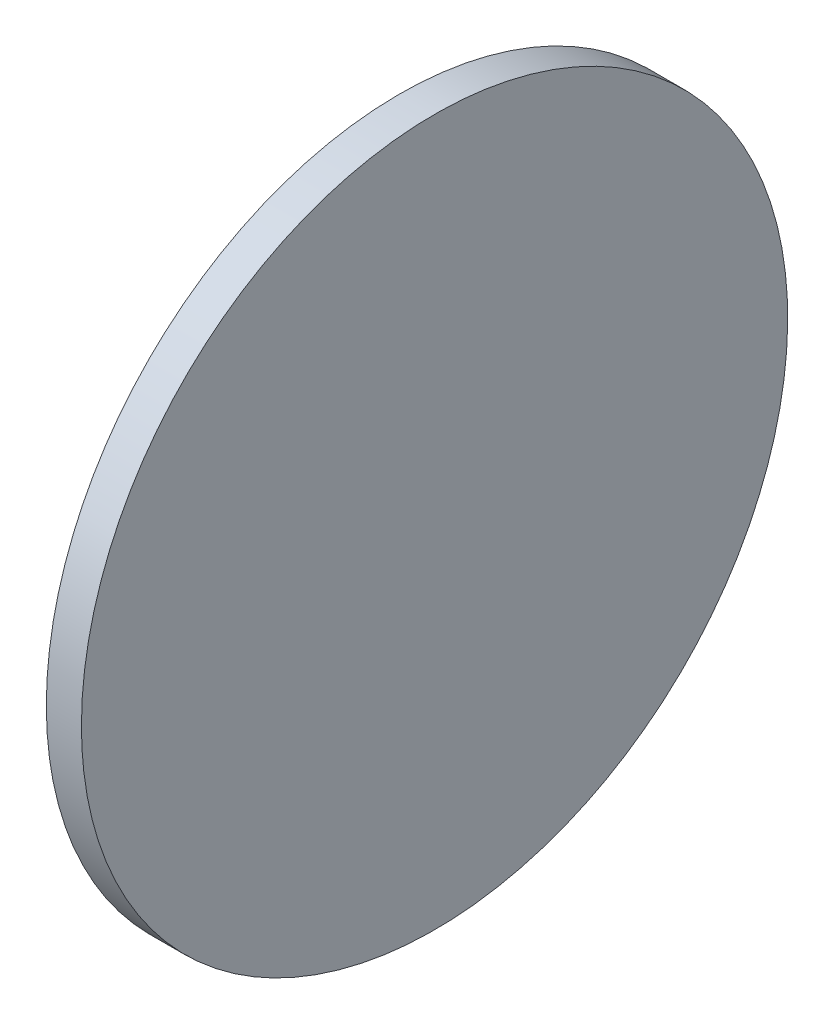
ISO-10303-21;
HEADER;
FILE_DESCRIPTION(('STEP AP214'),'2;1');
FILE_NAME('part.step','',(''),(''),'','','');
FILE_SCHEMA(('AUTOMOTIVE_DESIGN { 1 0 10303 214 1 1 1 1 }'));
ENDSEC;
DATA;
#1=APPLICATION_CONTEXT('core data for automotive mechanical design processes');
#2=APPLICATION_PROTOCOL_DEFINITION('international standard','automotive_design',2000,#1);
#3=PRODUCT_CONTEXT('',#1,'mechanical');
#4=PRODUCT('Part','Part','',(#3));
#5=PRODUCT_RELATED_PRODUCT_CATEGORY('part','',(#4));
#6=PRODUCT_DEFINITION_FORMATION('','',#4);
#7=PRODUCT_DEFINITION_CONTEXT('part definition',#1,'design');
#8=PRODUCT_DEFINITION('design','',#6,#7);
#9=PRODUCT_DEFINITION_SHAPE('','',#8);
#10=(LENGTH_UNIT() NAMED_UNIT(*) SI_UNIT(.MILLI.,.METRE.));
#11=(NAMED_UNIT(*) PLANE_ANGLE_UNIT() SI_UNIT($,.RADIAN.));
#12=(NAMED_UNIT(*) SI_UNIT($,.STERADIAN.) SOLID_ANGLE_UNIT());
#13=UNCERTAINTY_MEASURE_WITH_UNIT(LENGTH_MEASURE(1.E-05),#10,'distance_accuracy_value','');
#14=(GEOMETRIC_REPRESENTATION_CONTEXT(3) GLOBAL_UNCERTAINTY_ASSIGNED_CONTEXT((#13)) GLOBAL_UNIT_ASSIGNED_CONTEXT((#10,
#11,#12)) REPRESENTATION_CONTEXT('',''));
#15=CARTESIAN_POINT('',(0.,0.,0.));
#16=DIRECTION('',(0.,0.,1.));
#17=DIRECTION('',(1.,0.,0.));
#18=AXIS2_PLACEMENT_3D('',#15,#16,#17);
#19=CARTESIAN_POINT('',(-57.6828547032886,-10.1015554934087,30.2828427124814));
#20=CARTESIAN_POINT('',(-57.6828547032886,-9.42855059459681,30.2828427124814));
#21=CARTESIAN_POINT('',(-57.6828547032885,-8.08254079697294,30.150272318581));
#22=CARTESIAN_POINT('',(-57.6828547032886,-6.14111570304469,29.5613474548658));
#23=CARTESIAN_POINT('',(-57.6828547032886,-4.3518880892199,28.6049853705257));
#24=CARTESIAN_POINT('',(-57.6828547032886,-2.78361696928747,27.3179385241281));
#25=CARTESIAN_POINT('',(-57.6828547032886,-1.49657012288981,25.7496674041957));
#26=CARTESIAN_POINT('',(-57.6828547032886,-0.540208038549796,23.9604397903709));
#27=CARTESIAN_POINT('',(-57.6828547032886,0.0487168251654114,22.0190146964426));
#28=CARTESIAN_POINT('',(-57.6828547032886,0.247572416016112,20.0000000000068));
#29=CARTESIAN_POINT('',(-57.6828547032886,0.0487168251654121,17.980985303571));
#30=CARTESIAN_POINT('',(-57.6828547032886,-0.540208038549797,16.0395602096428));
#31=CARTESIAN_POINT('',(-57.6828547032886,-1.49657012288981,14.250332595818));
#32=CARTESIAN_POINT('',(-57.6828547032886,-2.78361696928747,12.6820614758856));
#33=CARTESIAN_POINT('',(-57.6828547032886,-4.3518880892199,11.3950146294879));
#34=CARTESIAN_POINT('',(-57.6828547032886,-6.14111570304469,10.4386525451479));
#35=CARTESIAN_POINT('',(-57.6828547032886,-8.08254079697294,9.84972768143268));
#36=CARTESIAN_POINT('',(-57.6828547032886,-10.1015554934087,9.65087209058198));
#37=CARTESIAN_POINT('',(-57.6828547032886,-12.1205701898445,9.84972768143268));
#38=CARTESIAN_POINT('',(-57.6828547032886,-14.0619952837728,10.4386525451479));
#39=CARTESIAN_POINT('',(-57.6828547032886,-15.8512228975976,11.3950146294879));
#40=CARTESIAN_POINT('',(-57.6828547032886,-17.41949401753,12.6820614758856));
#41=CARTESIAN_POINT('',(-57.6828547032886,-18.7065408639277,14.250332595818));
#42=CARTESIAN_POINT('',(-57.6828547032886,-19.6629029482677,16.0395602096428));
#43=CARTESIAN_POINT('',(-57.6828547032886,-20.2518278119829,17.980985303571));
#44=CARTESIAN_POINT('',(-57.6828547032886,-20.4506834028336,20.0000000000068));
#45=CARTESIAN_POINT('',(-57.6828547032886,-20.2518278119829,22.0190146964426));
#46=CARTESIAN_POINT('',(-57.6828547032886,-19.6629029482677,23.9604397903709));
#47=CARTESIAN_POINT('',(-57.6828547032886,-18.7065408639277,25.7496674041956));
#48=CARTESIAN_POINT('',(-57.6828547032886,-17.41949401753,27.3179385241281));
#49=CARTESIAN_POINT('',(-57.6828547032886,-15.8512228975976,28.6049853705257));
#50=CARTESIAN_POINT('',(-57.6828547032886,-14.0619952837728,29.5613474548658));
#51=CARTESIAN_POINT('',(-57.6828547032886,-12.1205701898445,30.150272318581));
#52=CARTESIAN_POINT('',(-57.6828547032886,-10.7745603922207,30.2828427124814));
#53=CARTESIAN_POINT('',(-57.6828547032886,-10.1015554934087,30.2828427124814));
#54=B_SPLINE_CURVE_WITH_KNOTS('',3,(#19,#20,#21,#22,#23,#24,#25,#26,#27,#28,#29,#30,#31,#32,#33,
#34,#35,#36,#37,#38,#39,#40,#41,#42,#43,#44,#45,#46,#47,#48,#49,#50,#51,#52,#53),.UNSPECIFIED.,
.T.,.F.,(4,1,1,1,1,1,1,1,1,1,1,1,1,1,1,1,1,1,1,1,1,1,1,1,1,1,1,1,1,1,1,1,4),(0.,0.03125,0.0625,
0.09375,0.125,0.15625,0.1875,0.21875,0.25,0.28125,0.3125,0.34375,0.375,0.40625,0.4375,0.46875,
0.5,0.53125,0.5625,0.59375,0.625,0.65625,0.6875,0.71875,0.75,0.78125,0.8125,0.84375,0.875,
0.90625,0.9375,0.96875,1.),.UNSPECIFIED.);
#55=DIRECTION('',(-1.,0.,0.));
#56=VECTOR('',#55,1.);
#57=SURFACE_OF_LINEAR_EXTRUSION('',#54,#56);
#58=CARTESIAN_POINT('',(-57.6828547032886,-10.1015554934087,30.2828427124814));
#59=CARTESIAN_POINT('',(-57.6828547032886,-9.42855059459681,30.2828427124814));
#60=CARTESIAN_POINT('',(-57.6828547032885,-8.08254079697294,30.150272318581));
#61=CARTESIAN_POINT('',(-57.6828547032886,-6.14111570304469,29.5613474548658));
#62=CARTESIAN_POINT('',(-57.6828547032885,-4.3518880892199,28.6049853705257));
#63=CARTESIAN_POINT('',(-57.6828547032886,-2.78361696928747,27.3179385241281));
#64=CARTESIAN_POINT('',(-57.6828547032886,-1.49657012288981,25.7496674041957));
#65=CARTESIAN_POINT('',(-57.6828547032886,-0.540208038549796,23.9604397903709));
#66=CARTESIAN_POINT('',(-57.6828547032886,0.0487168251654114,22.0190146964426));
#67=CARTESIAN_POINT('',(-57.6828547032885,0.247572416016112,20.0000000000068));
#68=CARTESIAN_POINT('',(-57.6828547032886,0.0487168251654121,17.980985303571));
#69=CARTESIAN_POINT('',(-57.6828547032885,-0.540208038549797,16.0395602096428));
#70=CARTESIAN_POINT('',(-57.6828547032886,-1.49657012288981,14.250332595818));
#71=CARTESIAN_POINT('',(-57.6828547032886,-2.78361696928747,12.6820614758856));
#72=CARTESIAN_POINT('',(-57.6828547032886,-4.3518880892199,11.3950146294879));
#73=CARTESIAN_POINT('',(-57.6828547032885,-6.14111570304469,10.4386525451479));
#74=CARTESIAN_POINT('',(-57.6828547032886,-8.08254079697294,9.84972768143268));
#75=CARTESIAN_POINT('',(-57.6828547032886,-10.1015554934087,9.65087209058198));
#76=CARTESIAN_POINT('',(-57.6828547032886,-12.1205701898445,9.84972768143268));
#77=CARTESIAN_POINT('',(-57.6828547032886,-14.0619952837728,10.4386525451479));
#78=CARTESIAN_POINT('',(-57.6828547032886,-15.8512228975976,11.3950146294879));
#79=CARTESIAN_POINT('',(-57.6828547032886,-17.41949401753,12.6820614758856));
#80=CARTESIAN_POINT('',(-57.6828547032886,-18.7065408639277,14.250332595818));
#81=CARTESIAN_POINT('',(-57.6828547032885,-19.6629029482677,16.0395602096428));
#82=CARTESIAN_POINT('',(-57.6828547032886,-20.2518278119829,17.980985303571));
#83=CARTESIAN_POINT('',(-57.6828547032885,-20.4506834028336,20.0000000000068));
#84=CARTESIAN_POINT('',(-57.6828547032886,-20.2518278119829,22.0190146964426));
#85=CARTESIAN_POINT('',(-57.6828547032886,-19.6629029482677,23.9604397903709));
#86=CARTESIAN_POINT('',(-57.6828547032886,-18.7065408639277,25.7496674041956));
#87=CARTESIAN_POINT('',(-57.6828547032886,-17.41949401753,27.3179385241281));
#88=CARTESIAN_POINT('',(-57.6828547032886,-15.8512228975976,28.6049853705257));
#89=CARTESIAN_POINT('',(-57.6828547032886,-14.0619952837728,29.5613474548658));
#90=CARTESIAN_POINT('',(-57.6828547032886,-12.1205701898445,30.150272318581));
#91=CARTESIAN_POINT('',(-57.6828547032886,-10.7745603922207,30.2828427124814));
#92=CARTESIAN_POINT('',(-57.6828547032886,-10.1015554934087,30.2828427124814));
#93=B_SPLINE_CURVE_WITH_KNOTS('',3,(#58,#59,#60,#61,#62,#63,#64,#65,#66,#67,#68,#69,#70,#71,#72,
#73,#74,#75,#76,#77,#78,#79,#80,#81,#82,#83,#84,#85,#86,#87,#88,#89,#90,#91,#92),.UNSPECIFIED.,
.T.,.F.,(4,1,1,1,1,1,1,1,1,1,1,1,1,1,1,1,1,1,1,1,1,1,1,1,1,1,1,1,1,1,1,1,4),(0.,0.03125,0.0625,
0.09375,0.125,0.15625,0.1875,0.21875,0.25,0.28125,0.3125,0.34375,0.375,0.40625,0.4375,0.46875,
0.5,0.53125,0.5625,0.59375,0.625,0.65625,0.6875,0.71875,0.75,0.78125,0.8125,0.84375,0.875,
0.90625,0.9375,0.96875,1.),.UNSPECIFIED.);
#94=CARTESIAN_POINT('',(-57.6828547032886,-10.1015554934087,30.2828427124814));
#95=VERTEX_POINT('',#94);
#96=EDGE_CURVE('E9',#95,#95,#93,.T.);
#97=ORIENTED_EDGE('',*,*,#96,.T.);
#98=EDGE_LOOP('',(#97));
#99=FACE_BOUND('',#98,.T.);
#100=CARTESIAN_POINT('',(-58.7052049368191,-10.1015554934087,30.2828427124814));
#101=CARTESIAN_POINT('',(-58.7052049368192,-10.2698077512351,30.2828426775823));
#102=CARTESIAN_POINT('',(-58.7052049368192,-10.438058784543,30.2786998381964));
#103=CARTESIAN_POINT('',(-58.7052049368191,-10.7741567433599,30.2621683753116));
#104=CARTESIAN_POINT('',(-58.7052049368191,-10.9420036657198,30.2497796877606));
#105=CARTESIAN_POINT('',(-58.7052049368191,-11.276889117429,30.2167963546452));
#106=CARTESIAN_POINT('',(-58.7052049368191,-11.4439276467783,30.1962017090808));
#107=CARTESIAN_POINT('',(-58.7052049368191,-11.7767930540147,30.1468460112992));
#108=CARTESIAN_POINT('',(-58.7052049368191,-11.9426199413037,30.1180850225185));
#109=CARTESIAN_POINT('',(-58.7052049368191,-12.2726572375495,30.0524365236886));
#110=CARTESIAN_POINT('',(-58.7052049368191,-12.4368676465063,30.0155490136396));
#111=CARTESIAN_POINT('',(-58.7052049368191,-12.7632828148587,29.9337656470033));
#112=CARTESIAN_POINT('',(-58.7052049368191,-12.9254875586649,29.8888697282104));
#113=CARTESIAN_POINT('',(-58.7052049368191,-13.247503453177,29.7911872746742));
#114=CARTESIAN_POINT('',(-58.7052049368191,-13.407314603883,29.7384007399309));
#115=CARTESIAN_POINT('',(-58.7052049368191,-13.7241553029591,29.6250545719401));
#116=CARTESIAN_POINT('',(-58.7052049368191,-13.8811848729266,29.5644949990759));
#117=CARTESIAN_POINT('',(-58.7052049368191,-14.1920732012511,29.4357208371141));
#118=CARTESIAN_POINT('',(-58.7052049368191,-14.3459319596082,29.3675062480165));
#119=CARTESIAN_POINT('',(-58.7052049368191,-14.6501200105826,29.2236138850579));
#120=CARTESIAN_POINT('',(-58.7052049368191,-14.8004492757742,29.1479360532279));
#121=CARTESIAN_POINT('',(-58.7052049368191,-15.0972208233463,28.9893083562185));
#122=CARTESIAN_POINT('',(-58.7052049368191,-15.2436631057269,28.9063584910392));
#123=CARTESIAN_POINT('',(-58.7052049368191,-15.5323030593363,28.733377683839));
#124=CARTESIAN_POINT('',(-58.7052049368191,-15.6745007635276,28.6433467968277));
#125=CARTESIAN_POINT('',(-58.7052049368191,-15.9542928670367,28.4563956902046));
#126=CARTESIAN_POINT('',(-58.7052049368191,-16.0918872663545,28.3594754705927));
#127=CARTESIAN_POINT('',(-58.7052049368191,-16.3621584218092,28.15900381422));
#128=CARTESIAN_POINT('',(-58.7052049368191,-16.4948351397382,28.0554523259545));
#129=CARTESIAN_POINT('',(-58.7052049368191,-16.7549575767466,27.841975358883));
#130=CARTESIAN_POINT('',(-58.7052049368191,-16.8824032958261,27.7320498800771));
#131=CARTESIAN_POINT('',(-58.7052049368191,-17.1317502322838,27.5060819890863));
#132=CARTESIAN_POINT('',(-58.7052049368191,-17.2536514927231,27.3900396244234));
#133=CARTESIAN_POINT('',(-58.7052049368191,-17.4915951178253,27.1520959993212));
#134=CARTESIAN_POINT('',(-58.7052049368191,-17.6076374824882,27.0301947388819));
#135=CARTESIAN_POINT('',(-58.7052049368191,-17.833605373479,26.7808478024241));
#136=CARTESIAN_POINT('',(-58.7052049368191,-17.9435308522849,26.6534020833447));
#137=CARTESIAN_POINT('',(-58.7052049368191,-18.1570078193564,26.3932796463363));
#138=CARTESIAN_POINT('',(-58.7052049368191,-18.2605593076219,26.2606029284073));
#139=CARTESIAN_POINT('',(-58.7052049368191,-18.4610309639946,25.9903317729525));
#140=CARTESIAN_POINT('',(-58.7052049368191,-18.5579511836065,25.8527373736347));
#141=CARTESIAN_POINT('',(-58.7052049368191,-18.7449022902296,25.5729452701258));
#142=CARTESIAN_POINT('',(-58.7052049368191,-18.8349331772409,25.4307475659347));
#143=CARTESIAN_POINT('',(-58.7052049368191,-19.0079139844411,25.1421076123246));
#144=CARTESIAN_POINT('',(-58.7052049368191,-19.0908638496205,24.9956653299431));
#145=CARTESIAN_POINT('',(-58.7052049368191,-19.2494915466297,24.6988937823736));
#146=CARTESIAN_POINT('',(-58.7052049368191,-19.3251693784596,24.5485645171857));
#147=CARTESIAN_POINT('',(-58.7052049368191,-19.4690617414186,24.2443764662012));
#148=CARTESIAN_POINT('',(-58.7052049368191,-19.5372763305169,24.0905177078304));
#149=CARTESIAN_POINT('',(-58.7052049368191,-19.6660504924769,23.7796293795435));
#150=CARTESIAN_POINT('',(-58.7052049368191,-19.7266100653386,23.6225998096273));
#151=CARTESIAN_POINT('',(-58.7052049368191,-19.8399562333363,23.305759110411));
#152=CARTESIAN_POINT('',(-58.7052049368191,-19.8927427680891,23.1459479595134));
#153=CARTESIAN_POINT('',(-58.7052049368191,-19.9904252215994,22.8239320655246));
#154=CARTESIAN_POINT('',(-58.7052049368191,-20.035321140357,22.6617273224333));
#155=CARTESIAN_POINT('',(-58.7052049368191,-20.1171045070897,22.3353121521278));
#156=CARTESIAN_POINT('',(-58.7052049368191,-20.1539920172704,22.1711017405033));
#157=CARTESIAN_POINT('',(-58.7052049368191,-20.2196405157405,21.8410644515461));
#158=CARTESIAN_POINT('',(-58.7052049368191,-20.2484015040298,21.6752375742135));
#159=CARTESIAN_POINT('',(-58.7052049368191,-20.2977572031541,21.3423721397755));
#160=CARTESIAN_POINT('',(-58.7052049368191,-20.3183518505527,21.1753335732679));
#161=CARTESIAN_POINT('',(-58.7052049368191,-20.3513351786568,20.8404482230771));
#162=CARTESIAN_POINT('',(-58.7052049368191,-20.3637238593622,20.6726014393939));
#163=CARTESIAN_POINT('',(-58.7052049368191,-20.3802553409496,20.3365031017066));
#164=CARTESIAN_POINT('',(-58.7052049368191,-20.3843982058833,20.1682515508567));
#165=CARTESIAN_POINT('',(-58.7052049368191,-20.3843982058833,19.8317484491569));
#166=CARTESIAN_POINT('',(-58.7052049368191,-20.3802553409496,19.6634968983071));
#167=CARTESIAN_POINT('',(-58.7052049368191,-20.3637238593622,19.3273985606197));
#168=CARTESIAN_POINT('',(-58.7052049368191,-20.3513351786568,19.1595517769366));
#169=CARTESIAN_POINT('',(-58.7052049368191,-20.3183518505527,18.8246664267458));
#170=CARTESIAN_POINT('',(-58.7052049368191,-20.2977572031541,18.6576278602381));
#171=CARTESIAN_POINT('',(-58.7052049368191,-20.2484015040298,18.3247624258001));
#172=CARTESIAN_POINT('',(-58.7052049368191,-20.2196405157405,18.1589355484675));
#173=CARTESIAN_POINT('',(-58.7052049368191,-20.1539920172704,17.8288982595104));
#174=CARTESIAN_POINT('',(-58.7052049368191,-20.1171045070897,17.6646878478858));
#175=CARTESIAN_POINT('',(-58.7052049368191,-20.035321140357,17.3382726775803));
#176=CARTESIAN_POINT('',(-58.7052049368191,-19.9904252215994,17.176067934489));
#177=CARTESIAN_POINT('',(-58.7052049368191,-19.8927427680891,16.8540520405002));
#178=CARTESIAN_POINT('',(-58.7052049368191,-19.8399562333363,16.6942408896027));
#179=CARTESIAN_POINT('',(-58.7052049368191,-19.7266100653386,16.3774001903863));
#180=CARTESIAN_POINT('',(-58.7052049368191,-19.6660504924769,16.2203706204702));
#181=CARTESIAN_POINT('',(-58.7052049368191,-19.5372763305169,15.9094822921832));
#182=CARTESIAN_POINT('',(-58.7052049368191,-19.4690617414186,15.7556235338124));
#183=CARTESIAN_POINT('',(-58.7052049368191,-19.3251693784596,15.4514354828279));
#184=CARTESIAN_POINT('',(-58.7052049368191,-19.2494915466297,15.30110621764));
#185=CARTESIAN_POINT('',(-58.7052049368191,-19.0908638496205,15.0043346700706));
#186=CARTESIAN_POINT('',(-58.7052049368191,-19.0079139844411,14.857892387689));
#187=CARTESIAN_POINT('',(-58.7052049368191,-18.8349331772409,14.5692524340789));
#188=CARTESIAN_POINT('',(-58.7052049368191,-18.7449022902296,14.4270547298878));
#189=CARTESIAN_POINT('',(-58.7052049368191,-18.5579511836065,14.1472626263789));
#190=CARTESIAN_POINT('',(-58.7052049368191,-18.4610309639946,14.0096682270611));
#191=CARTESIAN_POINT('',(-58.7052049368191,-18.2605593076219,13.7393970716063));
#192=CARTESIAN_POINT('',(-58.7052049368191,-18.1570078193564,13.6067203536774));
#193=CARTESIAN_POINT('',(-58.7052049368191,-17.9435308522849,13.346597916669));
#194=CARTESIAN_POINT('',(-58.7052049368191,-17.833605373479,13.2191521975895));
#195=CARTESIAN_POINT('',(-58.7052049368191,-17.6076374824882,12.9698052611318));
#196=CARTESIAN_POINT('',(-58.7052049368191,-17.4915951178253,12.8479040006925));
#197=CARTESIAN_POINT('',(-58.7052049368191,-17.2536514927231,12.6099603755902));
#198=CARTESIAN_POINT('',(-58.7052049368191,-17.1317502322838,12.4939180109274));
#199=CARTESIAN_POINT('',(-58.7052049368191,-16.882403295826,12.2679501199366));
#200=CARTESIAN_POINT('',(-58.7052049368191,-16.7549575767466,12.1580246411306));
#201=CARTESIAN_POINT('',(-58.7052049368191,-16.4948351397382,11.9445476740592));
#202=CARTESIAN_POINT('',(-58.7052049368191,-16.3621584218092,11.8409961857937));
#203=CARTESIAN_POINT('',(-58.7052049368191,-16.0918872663544,11.640524529421));
#204=CARTESIAN_POINT('',(-58.7052049368191,-15.9542928670366,11.5436043098091));
#205=CARTESIAN_POINT('',(-58.7052049368191,-15.6745007635277,11.3566532031859));
#206=CARTESIAN_POINT('',(-58.7052049368191,-15.5323030593366,11.2666223161747));
#207=CARTESIAN_POINT('',(-58.7052049368191,-15.2436631057266,11.0936415089744));
#208=CARTESIAN_POINT('',(-58.7052049368191,-15.097220823345,11.0106916437951));
#209=CARTESIAN_POINT('',(-58.7052049368191,-14.8004492757755,10.8520639467858));
#210=CARTESIAN_POINT('',(-58.7052049368191,-14.6501200105876,10.776386114956));
#211=CARTESIAN_POINT('',(-58.7052049368191,-14.3459319596032,10.6324937519969));
#212=CARTESIAN_POINT('',(-58.7052049368191,-14.1920732012324,10.5642791628987));
#213=CARTESIAN_POINT('',(-58.7052049368191,-13.8811848729454,10.4355050009387));
#214=CARTESIAN_POINT('',(-58.7052049368191,-13.7241553030292,10.374945428077));
#215=CARTESIAN_POINT('',(-58.7052049368191,-13.4073146038129,10.2615992600793));
#216=CARTESIAN_POINT('',(-58.7052049368191,-13.2475034529153,10.2088127253265));
#217=CARTESIAN_POINT('',(-58.7052049368191,-12.9254875589265,10.1111302718161));
#218=CARTESIAN_POINT('',(-58.7052049368191,-12.7632828158352,10.0662343530585));
#219=CARTESIAN_POINT('',(-58.7052049368191,-12.4368676455298,9.98445098632588));
#220=CARTESIAN_POINT('',(-58.7052049368191,-12.2726572339052,9.94756347614512));
#221=CARTESIAN_POINT('',(-58.7052049368191,-11.942619944948,9.88191497767508));
#222=CARTESIAN_POINT('',(-58.7052049368191,-11.7767930676154,9.85315398938581));
#223=CARTESIAN_POINT('',(-58.7052049368191,-11.4439276331774,9.80379829026144));
#224=CARTESIAN_POINT('',(-58.7052049368191,-11.2768890666698,9.78320364286281));
#225=CARTESIAN_POINT('',(-58.7052049368191,-10.942003716479,9.75022031475877));
#226=CARTESIAN_POINT('',(-58.7052049368191,-10.7741569327958,9.73783163405335));
#227=CARTESIAN_POINT('',(-58.7052049368191,-10.4380585951085,9.72130015246599));
#228=CARTESIAN_POINT('',(-58.7052049368191,-10.2698070442586,9.71715728753221));
#229=CARTESIAN_POINT('',(-58.7052049368191,-9.93330394255885,9.71715728753221));
#230=CARTESIAN_POINT('',(-58.7052049368191,-9.76505239170897,9.72130015246599));
#231=CARTESIAN_POINT('',(-58.7052049368191,-9.42895405402162,9.73783163405335));
#232=CARTESIAN_POINT('',(-58.7052049368191,-9.26110727033847,9.75022031475876));
#233=CARTESIAN_POINT('',(-58.7052049368191,-8.92622192014769,9.78320364286281));
#234=CARTESIAN_POINT('',(-58.7052049368191,-8.75918335364005,9.80379829026144));
#235=CARTESIAN_POINT('',(-58.7052049368191,-8.42631791920202,9.85315398938581));
#236=CARTESIAN_POINT('',(-58.7052049368191,-8.26049104186944,9.88191497767508));
#237=CARTESIAN_POINT('',(-58.7052049368191,-7.93045375291229,9.94756347614511));
#238=CARTESIAN_POINT('',(-58.7052049368191,-7.7662433412877,9.98445098632587));
#239=CARTESIAN_POINT('',(-58.7052049368191,-7.43982817098224,10.0662343530585));
#240=CARTESIAN_POINT('',(-58.7052049368191,-7.27762342789096,10.1111302718161));
#241=CARTESIAN_POINT('',(-58.7052049368191,-6.95560753390214,10.2088127253265));
#242=CARTESIAN_POINT('',(-58.7052049368191,-6.7957963830046,10.2615992600792));
#243=CARTESIAN_POINT('',(-58.7052049368191,-6.47895568378826,10.374945428077));
#244=CARTESIAN_POINT('',(-58.7052049368191,-6.32192611387209,10.4355050009387));
#245=CARTESIAN_POINT('',(-58.7052049368191,-6.01103778558511,10.5642791628987));
#246=CARTESIAN_POINT('',(-58.7052049368191,-5.85717902721431,10.6324937519969));
#247=CARTESIAN_POINT('',(-58.7052049368191,-5.55299097622983,10.776386114956));
#248=CARTESIAN_POINT('',(-58.7052049368191,-5.40266171104194,10.8520639467858));
#249=CARTESIAN_POINT('',(-58.7052049368191,-5.10589016347248,11.0106916437951));
#250=CARTESIAN_POINT('',(-58.7052049368191,-4.95944788109091,11.0936415089744));
#251=CARTESIAN_POINT('',(-58.7052049368191,-4.67080792748083,11.2666223161747));
#252=CARTESIAN_POINT('',(-58.7052049368191,-4.52861022328975,11.3566532031859));
#253=CARTESIAN_POINT('',(-58.7052049368191,-4.24881811978084,11.5436043098091));
#254=CARTESIAN_POINT('',(-58.7052049368192,-4.11122372046302,11.640524529421));
#255=CARTESIAN_POINT('',(-58.7052049368191,-3.84095256500824,11.8409961857937));
#256=CARTESIAN_POINT('',(-58.7052049368191,-3.70827584707929,11.9445476740592));
#257=CARTESIAN_POINT('',(-58.7052049368191,-3.44815341007088,12.1580246411306));
#258=CARTESIAN_POINT('',(-58.7052049368191,-3.32070769099142,12.2679501199366));
#259=CARTESIAN_POINT('',(-58.7052049368191,-3.07136075453369,12.4939180109274));
#260=CARTESIAN_POINT('',(-58.7052049368191,-2.94945949409437,12.6099603755902));
#261=CARTESIAN_POINT('',(-58.7052049368191,-2.71151586899216,12.8479040006925));
#262=CARTESIAN_POINT('',(-58.7052049368191,-2.59547350432927,12.9698052611318));
#263=CARTESIAN_POINT('',(-58.7052049368191,-2.3695056133385,13.2191521975895));
#264=CARTESIAN_POINT('',(-58.7052049368191,-2.25958013453255,13.346597916669));
#265=CARTESIAN_POINT('',(-58.7052049368191,-2.04610316746108,13.6067203536774));
#266=CARTESIAN_POINT('',(-58.7052049368191,-1.94255167919557,13.7393970716063));
#267=CARTESIAN_POINT('',(-58.7052049368191,-1.74208002282288,14.0096682270611));
#268=CARTESIAN_POINT('',(-58.7052049368191,-1.64515980321099,14.1472626263789));
#269=CARTESIAN_POINT('',(-58.7052049368191,-1.45820869658784,14.4270547298878));
#270=CARTESIAN_POINT('',(-58.7052049368191,-1.36817780957657,14.5692524340789));
#271=CARTESIAN_POINT('',(-58.7052049368191,-1.19519700237634,14.857892387689));
#272=CARTESIAN_POINT('',(-58.7052049368191,-1.11224713719697,15.0043346700706));
#273=CARTESIAN_POINT('',(-58.7052049368191,-0.95361944018774,15.30110621764));
#274=CARTESIAN_POINT('',(-58.7052049368191,-0.877941608357881,15.4514354828279));
#275=CARTESIAN_POINT('',(-58.7052049368191,-0.734049245398835,15.7556235338124));
#276=CARTESIAN_POINT('',(-58.7052049368191,-0.66583465630058,15.9094822921832));
#277=CARTESIAN_POINT('',(-58.7052049368191,-0.537060494340616,16.2203706204702));
#278=CARTESIAN_POINT('',(-58.7052049368191,-0.476500921478905,16.3774001903863));
#279=CARTESIAN_POINT('',(-58.7052049368191,-0.363154753481161,16.6942408896027));
#280=CARTESIAN_POINT('',(-58.7052049368191,-0.310368218728401,16.8540520405002));
#281=CARTESIAN_POINT('',(-58.7052049368191,-0.212685765218039,17.176067934489));
#282=CARTESIAN_POINT('',(-58.7052049368191,-0.167789846460436,17.3382726775803));
#283=CARTESIAN_POINT('',(-58.7052049368191,-0.0860064797277837,17.6646878478858));
#284=CARTESIAN_POINT('',(-58.7052049368191,-0.0491189695470225,17.8288982595104));
#285=CARTESIAN_POINT('',(-58.7052049368191,0.0165295289230105,18.1589355484675));
#286=CARTESIAN_POINT('',(-58.7052049368191,0.0452905172122823,18.3247624258001));
#287=CARTESIAN_POINT('',(-58.7052049368191,0.09464621633665,18.6576278602381));
#288=CARTESIAN_POINT('',(-58.7052049368191,0.115240863735283,18.8246664267458));
#289=CARTESIAN_POINT('',(-58.7052049368191,0.148224191839329,19.1595517769366));
#290=CARTESIAN_POINT('',(-58.7052049368191,0.160612872544742,19.3273985606197));
#291=CARTESIAN_POINT('',(-58.7052049368191,0.177144354132105,19.6634968983071));
#292=CARTESIAN_POINT('',(-58.7052049368191,0.181287219065879,19.8317484491569));
#293=CARTESIAN_POINT('',(-58.7052049368191,0.181287219065879,20.1682515508567));
#294=CARTESIAN_POINT('',(-58.7052049368191,0.177144354132104,20.3365031017066));
#295=CARTESIAN_POINT('',(-58.7052049368191,0.160612872544742,20.6726014393939));
#296=CARTESIAN_POINT('',(-58.7052049368191,0.148224191839329,20.8404482230771));
#297=CARTESIAN_POINT('',(-58.7052049368191,0.115240863735282,21.1753335732679));
#298=CARTESIAN_POINT('',(-58.7052049368191,0.09464621633665,21.3423721397755));
#299=CARTESIAN_POINT('',(-58.7052049368191,0.0452905172122823,21.6752375742135));
#300=CARTESIAN_POINT('',(-58.7052049368191,0.0165295289230106,21.8410644515461));
#301=CARTESIAN_POINT('',(-58.7052049368191,-0.0491189695470226,22.1711017405033));
#302=CARTESIAN_POINT('',(-58.7052049368191,-0.0860064797277839,22.3353121521279));
#303=CARTESIAN_POINT('',(-58.7052049368191,-0.167789846460436,22.6617273224333));
#304=CARTESIAN_POINT('',(-58.7052049368191,-0.212685765218038,22.8239320655246));
#305=CARTESIAN_POINT('',(-58.7052049368191,-0.3103682187284,23.1459479595134));
#306=CARTESIAN_POINT('',(-58.7052049368191,-0.363154753481161,23.305759110411));
#307=CARTESIAN_POINT('',(-58.7052049368191,-0.476500921478904,23.6225998096273));
#308=CARTESIAN_POINT('',(-58.7052049368191,-0.537060494340613,23.7796293795435));
#309=CARTESIAN_POINT('',(-58.7052049368191,-0.665834656300578,24.0905177078305));
#310=CARTESIAN_POINT('',(-58.7052049368191,-0.734049245398834,24.2443764662013));
#311=CARTESIAN_POINT('',(-58.7052049368191,-0.87794160835788,24.5485645171857));
#312=CARTESIAN_POINT('',(-58.7052049368191,-0.953619440187737,24.6988937823736));
#313=CARTESIAN_POINT('',(-58.7052049368191,-1.11224713719696,24.9956653299431));
#314=CARTESIAN_POINT('',(-58.7052049368191,-1.19519700237633,25.1421076123247));
#315=CARTESIAN_POINT('',(-58.7052049368191,-1.36817780957656,25.4307475659347));
#316=CARTESIAN_POINT('',(-58.7052049368191,-1.45820869658784,25.5729452701258));
#317=CARTESIAN_POINT('',(-58.7052049368191,-1.64515980321099,25.8527373736347));
#318=CARTESIAN_POINT('',(-58.7052049368191,-1.74208002282288,25.9903317729525));
#319=CARTESIAN_POINT('',(-58.7052049368191,-1.94255167919557,26.2606029284073));
#320=CARTESIAN_POINT('',(-58.7052049368191,-2.04610316746108,26.3932796463363));
#321=CARTESIAN_POINT('',(-58.7052049368191,-2.25958013453254,26.6534020833447));
#322=CARTESIAN_POINT('',(-58.7052049368191,-2.3695056133385,26.7808478024241));
#323=CARTESIAN_POINT('',(-58.7052049368191,-2.59547350432927,27.0301947388819));
#324=CARTESIAN_POINT('',(-58.7052049368191,-2.71151586899216,27.1520959993212));
#325=CARTESIAN_POINT('',(-58.7052049368191,-2.94945949409437,27.3900396244234));
#326=CARTESIAN_POINT('',(-58.7052049368191,-3.07136075453369,27.5060819890863));
#327=CARTESIAN_POINT('',(-58.7052049368191,-3.32070769099142,27.7320498800771));
#328=CARTESIAN_POINT('',(-58.7052049368191,-3.44815341007087,27.841975358883));
#329=CARTESIAN_POINT('',(-58.7052049368191,-3.7082758470793,28.0554523259545));
#330=CARTESIAN_POINT('',(-58.7052049368191,-3.84095256500826,28.15900381422));
#331=CARTESIAN_POINT('',(-58.7052049368191,-4.11122372046299,28.3594754705927));
#332=CARTESIAN_POINT('',(-58.7052049368191,-4.24881811978074,28.4563956902046));
#333=CARTESIAN_POINT('',(-58.7052049368191,-4.52861022328985,28.6433467968277));
#334=CARTESIAN_POINT('',(-58.7052049368191,-4.67080792748119,28.733377683839));
#335=CARTESIAN_POINT('',(-58.7052049368191,-4.95944788109055,28.9063584910392));
#336=CARTESIAN_POINT('',(-58.7052049368191,-5.10589016347113,28.9893083562185));
#337=CARTESIAN_POINT('',(-58.7052049368191,-5.40266171104329,29.1479360532279));
#338=CARTESIAN_POINT('',(-58.7052049368191,-5.55299097623486,29.2236138850579));
#339=CARTESIAN_POINT('',(-58.7052049368191,-5.85717902720927,29.3675062480165));
#340=CARTESIAN_POINT('',(-58.7052049368191,-6.01103778556633,29.4357208371141));
#341=CARTESIAN_POINT('',(-58.7052049368191,-6.32192611389087,29.5644949990759));
#342=CARTESIAN_POINT('',(-58.7052049368191,-6.47895568385837,29.6250545719401));
#343=CARTESIAN_POINT('',(-58.7052049368191,-6.79579638293449,29.7384007399309));
#344=CARTESIAN_POINT('',(-58.7052049368191,-6.95560753364048,29.7911872746742));
#345=CARTESIAN_POINT('',(-58.7052049368191,-7.27762342815261,29.8888697282104));
#346=CARTESIAN_POINT('',(-58.7052049368191,-7.43982817195874,29.9337656470033));
#347=CARTESIAN_POINT('',(-58.7052049368191,-7.76624334031121,30.0155490136396));
#348=CARTESIAN_POINT('',(-58.7052049368191,-7.93045374926798,30.0524365236886));
#349=CARTESIAN_POINT('',(-58.7052049368191,-8.26049104551375,30.1180850225185));
#350=CARTESIAN_POINT('',(-58.7052049368191,-8.42631793280275,30.1468460112992));
#351=CARTESIAN_POINT('',(-58.7052049368191,-8.75918334003921,30.1962017090808));
#352=CARTESIAN_POINT('',(-58.7052049368191,-8.92622186938849,30.2167963546452));
#353=CARTESIAN_POINT('',(-58.7052049368191,-9.26110732109766,30.2497796877606));
#354=CARTESIAN_POINT('',(-58.7052049368191,-9.42895424345756,30.2621683753116));
#355=CARTESIAN_POINT('',(-58.7052049368191,-9.76505220227451,30.2786998381964));
#356=CARTESIAN_POINT('',(-58.7052049368191,-9.93330323558236,30.2828426775823));
#357=CARTESIAN_POINT('',(-58.7052049368191,-10.1015554934087,30.2828427124814));
#358=B_SPLINE_CURVE_WITH_KNOTS('',3,(#100,#101,#102,#103,#104,#105,#106,#107,#108,#109,#110,
#111,#112,#113,#114,#115,#116,#117,#118,#119,#120,#121,#122,#123,#124,#125,#126,#127,#128,#129,
#130,#131,#132,#133,#134,#135,#136,#137,#138,#139,#140,#141,#142,#143,#144,#145,#146,#147,#148,
#149,#150,#151,#152,#153,#154,#155,#156,#157,#158,#159,#160,#161,#162,#163,#164,#165,#166,#167,
#168,#169,#170,#171,#172,#173,#174,#175,#176,#177,#178,#179,#180,#181,#182,#183,#184,#185,#186,
#187,#188,#189,#190,#191,#192,#193,#194,#195,#196,#197,#198,#199,#200,#201,#202,#203,#204,#205,
#206,#207,#208,#209,#210,#211,#212,#213,#214,#215,#216,#217,#218,#219,#220,#221,#222,#223,#224,
#225,#226,#227,#228,#229,#230,#231,#232,#233,#234,#235,#236,#237,#238,#239,#240,#241,#242,#243,
#244,#245,#246,#247,#248,#249,#250,#251,#252,#253,#254,#255,#256,#257,#258,#259,#260,#261,#262,
#263,#264,#265,#266,#267,#268,#269,#270,#271,#272,#273,#274,#275,#276,#277,#278,#279,#280,#281,
#282,#283,#284,#285,#286,#287,#288,#289,#290,#291,#292,#293,#294,#295,#296,#297,#298,#299,#300,
#301,#302,#303,#304,#305,#306,#307,#308,#309,#310,#311,#312,#313,#314,#315,#316,#317,#318,#319,
#320,#321,#322,#323,#324,#325,#326,#327,#328,#329,#330,#331,#332,#333,#334,#335,#336,#337,#338,
#339,#340,#341,#342,#343,#344,#345,#346,#347,#348,#349,#350,#351,#352,#353,#354,#355,#356,#357),
.UNSPECIFIED.,.F.,.F.,(4,2,2,2,2,2,2,2,2,2,2,2,2,2,2,2,2,2,2,2,2,2,2,2,2,2,2,2,2,2,2,2,2,2,2,2,
2,2,2,2,2,2,2,2,2,2,2,2,2,2,2,2,2,2,2,2,2,2,2,2,2,2,2,2,2,2,2,2,2,2,2,2,2,2,2,2,2,2,2,2,2,2,2,2,
2,2,2,2,2,2,2,2,2,2,2,2,2,2,2,2,2,2,2,2,2,2,2,2,2,2,2,2,2,2,2,2,2,2,2,2,2,2,2,2,2,2,2,2,4),(0.,
0.504704178481684,1.00941227744886,1.51412037641604,2.01882455489772,2.52352873337941,
3.02823683234659,3.53294493131377,4.03764910979545,4.54235328827714,5.04706138724432,
5.55176948621149,6.05647366469318,6.56117784317486,7.06588594214204,7.57059404110922,
8.0752982195909,8.58000239807259,9.08471049703977,9.58941859600694,10.0941227744886,
10.5988269529703,11.1035350519375,11.6082431509047,12.1129473293864,12.617651507868,
13.1223596068352,13.6270677058024,14.1317718842841,14.6364760627658,15.1411841617329,
15.6458922607001,16.1505964391818,16.6553006176635,17.1600087166307,17.6647168155979,
18.1694209940795,18.6741251725612,19.1788332715284,19.6835413704956,20.1882455489773,
20.6929497274589,21.1976578264261,21.7023659253933,22.207070103875,22.7117742823567,
23.2164823813238,23.721190480291,24.2258946587727,24.7305988372544,25.2353069362216,
25.7400150351887,26.2447192136704,26.7494233921521,27.2541314911193,27.7588395900865,
28.2635437685682,28.7682479470498,29.272956046017,29.7776641449842,30.2823683234659,
30.7870725019476,31.2917806009147,31.7964886998819,32.3011928783636,32.8058970568453,
33.3106051558125,33.8153132547796,34.3200174332613,34.824721611743,35.3294297107102,
35.8341378096774,36.3388419881591,36.8435461666407,37.3482542656079,37.8529623645751,
38.3576665430568,38.8623707215385,39.3670788205056,39.8717869194728,40.3764910979545,
40.8811952764362,41.3859033754034,41.8906114743705,42.3953156528522,42.9000198313339,
43.4047279303011,43.9094360292683,44.41414020775,44.9188443862316,45.4235524851988,
45.928260584166,46.4329647626477,46.9376689411294,47.4423770400965,47.9470851390637,
48.4517893175454,48.9564934960271,49.4612015949943,49.9659096939615,50.4706138724431,
50.9753180509248,51.480026149892,51.9847342488592,52.4894384273409,52.9941426058226,
53.4988507047897,54.0035588037569,54.5082629822386,55.0129671607203,55.5176752596875,
56.0223833586546,56.5270875371363,57.031791715618,57.5364998145852,58.0412079135523,
58.545912092034,59.0506162705157,59.5553243694829,60.0600324684501,60.5647366469318,
61.0694408254135,61.5741489243806,62.0788570233478,62.5835612018295,63.0882653803112,
63.5929734792783,64.0976815782455,64.6023857567272),.UNSPECIFIED.);
#359=CARTESIAN_POINT('',(-58.7052049368191,-10.1015554934087,30.2828427124814));
#360=VERTEX_POINT('',#359);
#361=EDGE_CURVE('E24',#360,#360,#358,.F.);
#362=ORIENTED_EDGE('',*,*,#361,.F.);
#363=EDGE_LOOP('',(#362));
#364=FACE_BOUND('',#363,.T.);
#365=ADVANCED_FACE('F14',(#99,#364),#57,.T.);
#366=CARTESIAN_POINT('',(-57.6828547032886,-10.1015554934087,10.0000000000068));
#367=DIRECTION('',(-1.,0.,0.));
#368=DIRECTION('',(0.,-1.,0.));
#369=AXIS2_PLACEMENT_3D('',#366,#367,#368);
#370=PLANE('',#369);
#371=ORIENTED_EDGE('',*,*,#96,.F.);
#372=EDGE_LOOP('',(#371));
#373=FACE_BOUND('',#372,.T.);
#374=ADVANCED_FACE('F62',(#373),#370,.F.);
#375=CARTESIAN_POINT('',(-58.7052049368191,-10.1015554934087,10.0000000000068));
#376=DIRECTION('',(-1.,0.,0.));
#377=DIRECTION('',(0.,-1.,0.));
#378=AXIS2_PLACEMENT_3D('',#375,#376,#377);
#379=PLANE('',#378);
#380=ORIENTED_EDGE('',*,*,#361,.T.);
#381=EDGE_LOOP('',(#380));
#382=FACE_BOUND('',#381,.T.);
#383=ADVANCED_FACE('F31',(#382),#379,.T.);
#384=CLOSED_SHELL('',(#365,#374,#383));
#385=MANIFOLD_SOLID_BREP('B1',#384);
#386=ADVANCED_BREP_SHAPE_REPRESENTATION('',(#18,#385),#14);
#387=SHAPE_DEFINITION_REPRESENTATION(#9,#386);
ENDSEC;
END-ISO-10303-21;
